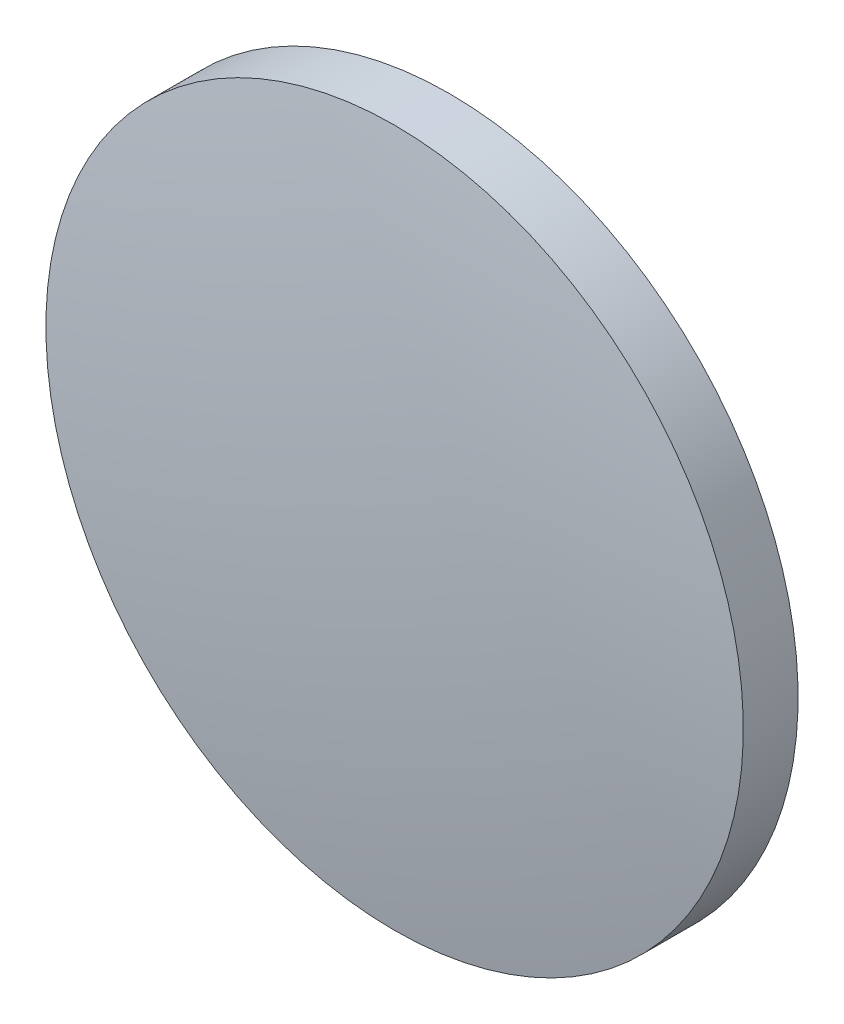
ISO-10303-21;
HEADER;
FILE_DESCRIPTION(('STEP AP214'),'2;1');
FILE_NAME('part.step','',(''),(''),'','','');
FILE_SCHEMA(('AUTOMOTIVE_DESIGN { 1 0 10303 214 1 1 1 1 }'));
ENDSEC;
DATA;
#1=APPLICATION_CONTEXT('core data for automotive mechanical design processes');
#2=APPLICATION_PROTOCOL_DEFINITION('international standard','automotive_design',2000,#1);
#3=PRODUCT_CONTEXT('',#1,'mechanical');
#4=PRODUCT('Part','Part','',(#3));
#5=PRODUCT_RELATED_PRODUCT_CATEGORY('part','',(#4));
#6=PRODUCT_DEFINITION_FORMATION('','',#4);
#7=PRODUCT_DEFINITION_CONTEXT('part definition',#1,'design');
#8=PRODUCT_DEFINITION('design','',#6,#7);
#9=PRODUCT_DEFINITION_SHAPE('','',#8);
#10=(LENGTH_UNIT() NAMED_UNIT(*) SI_UNIT(.MILLI.,.METRE.));
#11=(NAMED_UNIT(*) PLANE_ANGLE_UNIT() SI_UNIT($,.RADIAN.));
#12=(NAMED_UNIT(*) SI_UNIT($,.STERADIAN.) SOLID_ANGLE_UNIT());
#13=UNCERTAINTY_MEASURE_WITH_UNIT(LENGTH_MEASURE(1.E-05),#10,'distance_accuracy_value','');
#14=(GEOMETRIC_REPRESENTATION_CONTEXT(3) GLOBAL_UNCERTAINTY_ASSIGNED_CONTEXT((#13)) GLOBAL_UNIT_ASSIGNED_CONTEXT((#10,
#11,#12)) REPRESENTATION_CONTEXT('',''));
#15=CARTESIAN_POINT('',(0.,0.,0.));
#16=DIRECTION('',(0.,0.,1.));
#17=DIRECTION('',(1.,0.,0.));
#18=AXIS2_PLACEMENT_3D('',#15,#16,#17);
#19=CARTESIAN_POINT('',(0.,0.,-1.465));
#20=DIRECTION('',(0.,0.,-1.));
#21=DIRECTION('',(0.,1.,0.));
#22=AXIS2_PLACEMENT_3D('',#19,#20,#21);
#23=PLANE('',#22);
#24=CARTESIAN_POINT('',(0.,0.,-1.465));
#25=DIRECTION('',(0.,0.,-1.));
#26=DIRECTION('',(0.,1.,0.));
#27=AXIS2_PLACEMENT_3D('',#24,#25,#26);
#28=CIRCLE('',#27,12.7);
#29=CARTESIAN_POINT('',(0.,12.7,-1.465));
#30=VERTEX_POINT('',#29);
#31=EDGE_CURVE('E19',#30,#30,#28,.T.);
#32=ORIENTED_EDGE('',*,*,#31,.T.);
#33=EDGE_LOOP('',(#32));
#34=FACE_BOUND('',#33,.T.);
#35=ADVANCED_FACE('F13',(#34),#23,.T.);
#36=CARTESIAN_POINT('',(0.,0.,-85.305));
#37=DIRECTION('',(0.,0.,-1.));
#38=DIRECTION('',(0.,1.,0.));
#39=AXIS2_PLACEMENT_3D('',#36,#37,#38);
#40=SPHERICAL_SURFACE('',#39,86.7700000000001);
#41=CARTESIAN_POINT('',(0.,0.,0.530557317466217));
#42=DIRECTION('',(0.,0.,-1.));
#43=DIRECTION('',(0.,1.,0.));
#44=AXIS2_PLACEMENT_3D('',#41,#42,#43);
#45=CIRCLE('',#44,12.7);
#46=CARTESIAN_POINT('',(0.,12.7,0.530557317466221));
#47=VERTEX_POINT('',#46);
#48=EDGE_CURVE('E9',#47,#47,#45,.T.);
#49=ORIENTED_EDGE('',*,*,#48,.F.);
#50=EDGE_LOOP('',(#49));
#51=FACE_BOUND('',#50,.T.);
#52=ADVANCED_FACE('F28',(#51),#40,.T.);
#53=CARTESIAN_POINT('',(0.,0.,-1.465));
#54=DIRECTION('',(0.,0.,-1.));
#55=DIRECTION('',(0.,1.,0.));
#56=AXIS2_PLACEMENT_3D('',#53,#54,#55);
#57=CYLINDRICAL_SURFACE('',#56,12.7);
#58=ORIENTED_EDGE('',*,*,#48,.T.);
#59=EDGE_LOOP('',(#58));
#60=FACE_BOUND('',#59,.T.);
#61=ORIENTED_EDGE('',*,*,#31,.F.);
#62=EDGE_LOOP('',(#61));
#63=FACE_BOUND('',#62,.T.);
#64=ADVANCED_FACE('F26',(#60,#63),#57,.T.);
#65=CLOSED_SHELL('',(#35,#52,#64));
#66=MANIFOLD_SOLID_BREP('B1',#65);
#67=ADVANCED_BREP_SHAPE_REPRESENTATION('',(#18,#66),#14);
#68=SHAPE_DEFINITION_REPRESENTATION(#9,#67);
ENDSEC;
END-ISO-10303-21;
